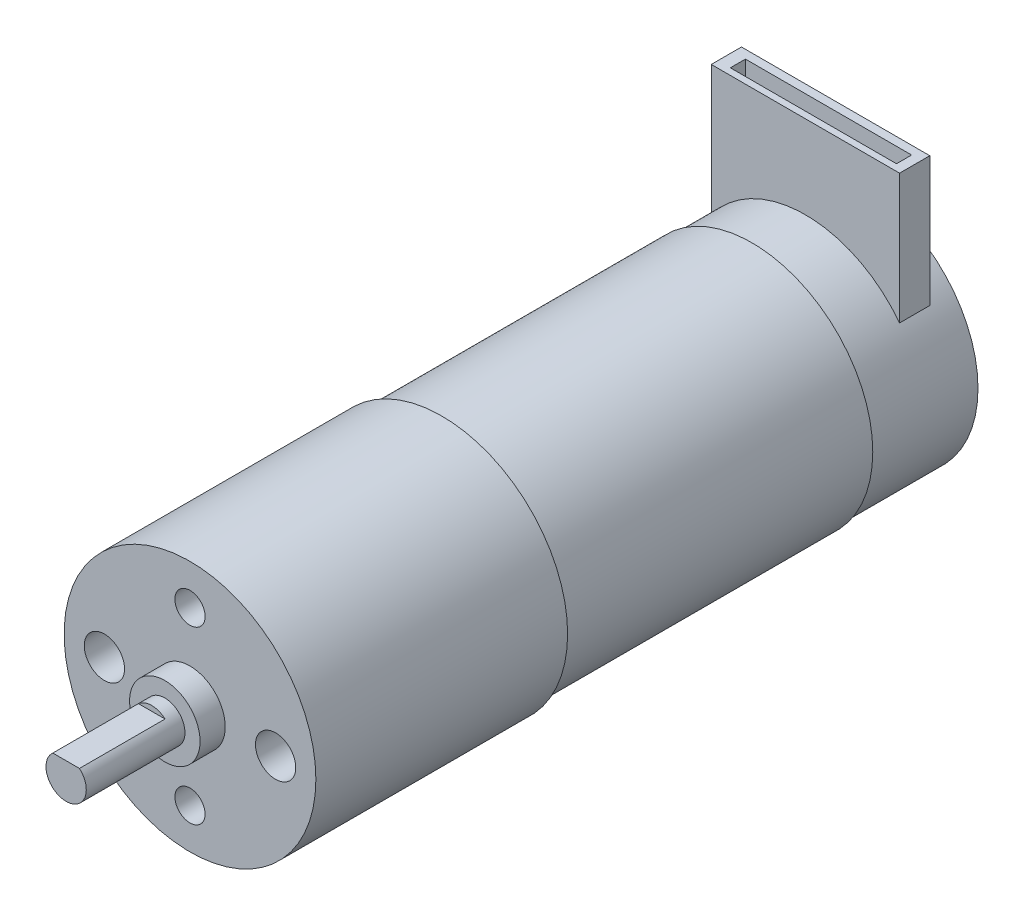
ISO-10303-21;
HEADER;
FILE_DESCRIPTION(('STEP AP214'),'2;1');
FILE_NAME('part.step','',(''),(''),'','','');
FILE_SCHEMA(('AUTOMOTIVE_DESIGN { 1 0 10303 214 1 1 1 1 }'));
ENDSEC;
DATA;
#1=APPLICATION_CONTEXT('core data for automotive mechanical design processes');
#2=APPLICATION_PROTOCOL_DEFINITION('international standard','automotive_design',2000,#1);
#3=PRODUCT_CONTEXT('',#1,'mechanical');
#4=PRODUCT('Part','Part','',(#3));
#5=PRODUCT_RELATED_PRODUCT_CATEGORY('part','',(#4));
#6=PRODUCT_DEFINITION_FORMATION('','',#4);
#7=PRODUCT_DEFINITION_CONTEXT('part definition',#1,'design');
#8=PRODUCT_DEFINITION('design','',#6,#7);
#9=PRODUCT_DEFINITION_SHAPE('','',#8);
#10=(LENGTH_UNIT() NAMED_UNIT(*) SI_UNIT(.MILLI.,.METRE.));
#11=(NAMED_UNIT(*) PLANE_ANGLE_UNIT() SI_UNIT($,.RADIAN.));
#12=(NAMED_UNIT(*) SI_UNIT($,.STERADIAN.) SOLID_ANGLE_UNIT());
#13=UNCERTAINTY_MEASURE_WITH_UNIT(LENGTH_MEASURE(1.E-05),#10,'distance_accuracy_value','');
#14=(GEOMETRIC_REPRESENTATION_CONTEXT(3) GLOBAL_UNCERTAINTY_ASSIGNED_CONTEXT((#13)) GLOBAL_UNIT_ASSIGNED_CONTEXT((#10,
#11,#12)) REPRESENTATION_CONTEXT('',''));
#15=CARTESIAN_POINT('',(0.,0.,0.));
#16=DIRECTION('',(0.,0.,1.));
#17=DIRECTION('',(1.,0.,0.));
#18=AXIS2_PLACEMENT_3D('',#15,#16,#17);
#19=CARTESIAN_POINT('',(0.,0.,-10.7));
#20=DIRECTION('',(0.,0.,1.));
#21=DIRECTION('',(1.,0.,0.));
#22=AXIS2_PLACEMENT_3D('',#19,#20,#21);
#23=CYLINDRICAL_SURFACE('',#22,11.75);
#24=CARTESIAN_POINT('',(0.,0.,0.));
#25=DIRECTION('',(0.,0.,1.));
#26=DIRECTION('',(1.,0.,0.));
#27=AXIS2_PLACEMENT_3D('',#24,#25,#26);
#28=CIRCLE('',#27,11.75);
#29=CARTESIAN_POINT('',(11.75,0.,0.));
#30=VERTEX_POINT('',#29);
#31=EDGE_CURVE('E233',#30,#30,#28,.F.);
#32=ORIENTED_EDGE('',*,*,#31,.T.);
#33=EDGE_LOOP('',(#32));
#34=FACE_BOUND('',#33,.T.);
#35=CARTESIAN_POINT('',(0.,0.,-10.7));
#36=DIRECTION('',(0.,0.,-1.));
#37=DIRECTION('',(-1.,0.,0.));
#38=AXIS2_PLACEMENT_3D('',#35,#36,#37);
#39=CIRCLE('',#38,11.75);
#40=CARTESIAN_POINT('',(-11.75,0.,-10.7));
#41=VERTEX_POINT('',#40);
#42=EDGE_CURVE('E195',#41,#41,#39,.T.);
#43=ORIENTED_EDGE('',*,*,#42,.F.);
#44=EDGE_LOOP('',(#43));
#45=FACE_BOUND('',#44,.T.);
#46=DIRECTION('',(0.,0.,1.));
#47=VECTOR('',#46,1.);
#48=CARTESIAN_POINT('',(-9.34971648878689,7.11655124195045,-10.7));
#49=LINE('',#48,#47);
#50=CARTESIAN_POINT('',(-9.34971648878689,7.11655124195045,-8.31237413965429));
#51=VERTEX_POINT('',#50);
#52=CARTESIAN_POINT('',(-9.34971648878689,7.11655124195045,-5.31237413965429));
#53=VERTEX_POINT('',#52);
#54=EDGE_CURVE('E12',#51,#53,#49,.T.);
#55=ORIENTED_EDGE('',*,*,#54,.F.);
#56=CARTESIAN_POINT('',(0.,0.,-8.31237413965429));
#57=DIRECTION('',(0.,0.,1.));
#58=DIRECTION('',(1.,0.,0.));
#59=AXIS2_PLACEMENT_3D('',#56,#57,#58);
#60=CIRCLE('',#59,11.75);
#61=CARTESIAN_POINT('',(9.34971648878689,7.11655124195045,-8.31237413965429));
#62=VERTEX_POINT('',#61);
#63=EDGE_CURVE('E238',#62,#51,#60,.T.);
#64=ORIENTED_EDGE('',*,*,#63,.F.);
#65=DIRECTION('',(0.,0.,1.));
#66=VECTOR('',#65,1.);
#67=CARTESIAN_POINT('',(9.34971648878689,7.11655124195045,-10.7));
#68=LINE('',#67,#66);
#69=CARTESIAN_POINT('',(9.34971648878689,7.11655124195045,-5.31237413965429));
#70=VERTEX_POINT('',#69);
#71=EDGE_CURVE('E241',#70,#62,#68,.F.);
#72=ORIENTED_EDGE('',*,*,#71,.F.);
#73=CARTESIAN_POINT('',(0.,0.,-5.31237413965429));
#74=DIRECTION('',(0.,0.,-1.));
#75=DIRECTION('',(-1.,0.,0.));
#76=AXIS2_PLACEMENT_3D('',#73,#74,#75);
#77=CIRCLE('',#76,11.75);
#78=EDGE_CURVE('E45',#53,#70,#77,.T.);
#79=ORIENTED_EDGE('',*,*,#78,.F.);
#80=EDGE_LOOP('',(#55,#64,#72,#79));
#81=FACE_BOUND('',#80,.T.);
#82=ADVANCED_FACE('F37',(#34,#45,#81),#23,.T.);
#83=CARTESIAN_POINT('',(0.,0.,68.1));
#84=DIRECTION('',(0.,0.,-1.));
#85=DIRECTION('',(-1.,0.,0.));
#86=AXIS2_PLACEMENT_3D('',#83,#84,#85);
#87=CYLINDRICAL_SURFACE('',#86,2.);
#88=CARTESIAN_POINT('',(0.,0.,58.3));
#89=DIRECTION('',(0.,0.,1.));
#90=DIRECTION('',(1.,0.,0.));
#91=AXIS2_PLACEMENT_3D('',#88,#89,#90);
#92=CIRCLE('',#91,2.);
#93=CARTESIAN_POINT('',(2.,0.,58.3));
#94=VERTEX_POINT('',#93);
#95=EDGE_CURVE('E209',#94,#94,#92,.T.);
#96=ORIENTED_EDGE('',*,*,#95,.T.);
#97=EDGE_LOOP('',(#96));
#98=FACE_BOUND('',#97,.T.);
#99=DIRECTION('',(0.,0.,1.));
#100=VECTOR('',#99,1.);
#101=CARTESIAN_POINT('',(1.3228756555323,1.5,59.6));
#102=LINE('',#101,#100);
#103=CARTESIAN_POINT('',(1.3228756555323,1.5,59.6));
#104=VERTEX_POINT('',#103);
#105=CARTESIAN_POINT('',(1.3228756555323,1.5,68.1));
#106=VERTEX_POINT('',#105);
#107=EDGE_CURVE('E204',#104,#106,#102,.T.);
#108=ORIENTED_EDGE('',*,*,#107,.T.);
#109=CARTESIAN_POINT('',(0.,0.,68.1));
#110=DIRECTION('',(0.,0.,1.));
#111=DIRECTION('',(1.,0.,0.));
#112=AXIS2_PLACEMENT_3D('',#109,#110,#111);
#113=CIRCLE('',#112,2.);
#114=CARTESIAN_POINT('',(-1.3228756555323,1.5,68.1));
#115=VERTEX_POINT('',#114);
#116=EDGE_CURVE('E212',#115,#106,#113,.T.);
#117=ORIENTED_EDGE('',*,*,#116,.F.);
#118=DIRECTION('',(0.,0.,1.));
#119=VECTOR('',#118,1.);
#120=CARTESIAN_POINT('',(-1.3228756555323,1.5,59.6));
#121=LINE('',#120,#119);
#122=CARTESIAN_POINT('',(-1.3228756555323,1.5,59.6));
#123=VERTEX_POINT('',#122);
#124=EDGE_CURVE('E207',#123,#115,#121,.T.);
#125=ORIENTED_EDGE('',*,*,#124,.F.);
#126=CARTESIAN_POINT('',(0.,0.,59.6));
#127=DIRECTION('',(0.,0.,1.));
#128=DIRECTION('',(1.,0.,0.));
#129=AXIS2_PLACEMENT_3D('',#126,#127,#128);
#130=CIRCLE('',#129,2.);
#131=EDGE_CURVE('E201',#104,#123,#130,.T.);
#132=ORIENTED_EDGE('',*,*,#131,.F.);
#133=EDGE_LOOP('',(#108,#117,#125,#132));
#134=FACE_BOUND('',#133,.T.);
#135=ADVANCED_FACE('F272',(#98,#134),#87,.T.);
#136=CARTESIAN_POINT('',(0.,0.,68.1));
#137=DIRECTION('',(0.,0.,1.));
#138=DIRECTION('',(1.,0.,0.));
#139=AXIS2_PLACEMENT_3D('',#136,#137,#138);
#140=PLANE('',#139);
#141=ORIENTED_EDGE('',*,*,#116,.T.);
#142=DIRECTION('',(-1.,0.,0.));
#143=VECTOR('',#142,1.);
#144=CARTESIAN_POINT('',(0.,1.5,68.1));
#145=LINE('',#144,#143);
#146=EDGE_CURVE('E198',#106,#115,#145,.T.);
#147=ORIENTED_EDGE('',*,*,#146,.T.);
#148=EDGE_LOOP('',(#141,#147));
#149=FACE_BOUND('',#148,.T.);
#150=ADVANCED_FACE('F278',(#149),#140,.T.);
#151=CARTESIAN_POINT('',(0.,0.,30.8));
#152=DIRECTION('',(0.,0.,-1.));
#153=DIRECTION('',(-1.,0.,0.));
#154=AXIS2_PLACEMENT_3D('',#151,#152,#153);
#155=CYLINDRICAL_SURFACE('',#154,12.);
#156=CARTESIAN_POINT('',(0.,0.,30.8));
#157=DIRECTION('',(0.,0.,1.));
#158=DIRECTION('',(1.,0.,0.));
#159=AXIS2_PLACEMENT_3D('',#156,#157,#158);
#160=CIRCLE('',#159,12.);
#161=CARTESIAN_POINT('',(12.,0.,30.8));
#162=VERTEX_POINT('',#161);
#163=EDGE_CURVE('E230',#162,#162,#160,.T.);
#164=ORIENTED_EDGE('',*,*,#163,.F.);
#165=EDGE_LOOP('',(#164));
#166=FACE_BOUND('',#165,.T.);
#167=CARTESIAN_POINT('',(0.,0.,0.));
#168=DIRECTION('',(0.,0.,1.));
#169=DIRECTION('',(1.,0.,0.));
#170=AXIS2_PLACEMENT_3D('',#167,#168,#169);
#171=CIRCLE('',#170,12.);
#172=CARTESIAN_POINT('',(12.,0.,0.));
#173=VERTEX_POINT('',#172);
#174=EDGE_CURVE('E227',#173,#173,#171,.T.);
#175=ORIENTED_EDGE('',*,*,#174,.T.);
#176=EDGE_LOOP('',(#175));
#177=FACE_BOUND('',#176,.T.);
#178=ADVANCED_FACE('F39',(#166,#177),#155,.T.);
#179=CARTESIAN_POINT('',(0.,0.,0.));
#180=DIRECTION('',(0.,0.,1.));
#181=DIRECTION('',(1.,0.,0.));
#182=AXIS2_PLACEMENT_3D('',#179,#180,#181);
#183=PLANE('',#182);
#184=ORIENTED_EDGE('',*,*,#31,.F.);
#185=EDGE_LOOP('',(#184));
#186=FACE_BOUND('',#185,.T.);
#187=ORIENTED_EDGE('',*,*,#174,.F.);
#188=EDGE_LOOP('',(#187));
#189=FACE_BOUND('',#188,.T.);
#190=ADVANCED_FACE('F315',(#186,#189),#183,.F.);
#191=CARTESIAN_POINT('',(0.,0.,55.8));
#192=DIRECTION('',(0.,0.,-1.));
#193=DIRECTION('',(-1.,0.,0.));
#194=AXIS2_PLACEMENT_3D('',#191,#192,#193);
#195=CYLINDRICAL_SURFACE('',#194,12.5);
#196=CARTESIAN_POINT('',(0.,0.,55.8));
#197=DIRECTION('',(0.,0.,1.));
#198=DIRECTION('',(1.,0.,0.));
#199=AXIS2_PLACEMENT_3D('',#196,#197,#198);
#200=CIRCLE('',#199,12.5);
#201=CARTESIAN_POINT('',(12.5,0.,55.8));
#202=VERTEX_POINT('',#201);
#203=EDGE_CURVE('E224',#202,#202,#200,.T.);
#204=ORIENTED_EDGE('',*,*,#203,.F.);
#205=EDGE_LOOP('',(#204));
#206=FACE_BOUND('',#205,.T.);
#207=CARTESIAN_POINT('',(0.,0.,30.8));
#208=DIRECTION('',(0.,0.,1.));
#209=DIRECTION('',(1.,0.,0.));
#210=AXIS2_PLACEMENT_3D('',#207,#208,#209);
#211=CIRCLE('',#210,12.5);
#212=CARTESIAN_POINT('',(12.5,0.,30.8));
#213=VERTEX_POINT('',#212);
#214=EDGE_CURVE('E221',#213,#213,#211,.T.);
#215=ORIENTED_EDGE('',*,*,#214,.T.);
#216=EDGE_LOOP('',(#215));
#217=FACE_BOUND('',#216,.T.);
#218=ADVANCED_FACE('F309',(#206,#217),#195,.T.);
#219=CARTESIAN_POINT('',(0.,0.,55.8));
#220=DIRECTION('',(0.,0.,1.));
#221=DIRECTION('',(1.,0.,0.));
#222=AXIS2_PLACEMENT_3D('',#219,#220,#221);
#223=PLANE('',#222);
#224=CARTESIAN_POINT('',(8.5,0.,55.8));
#225=DIRECTION('',(0.,0.,-1.));
#226=DIRECTION('',(-1.,0.,0.));
#227=AXIS2_PLACEMENT_3D('',#224,#225,#226);
#228=CIRCLE('',#227,2.);
#229=CARTESIAN_POINT('',(6.5,0.,55.8));
#230=VERTEX_POINT('',#229);
#231=EDGE_CURVE('E147',#230,#230,#228,.T.);
#232=ORIENTED_EDGE('',*,*,#231,.T.);
#233=EDGE_LOOP('',(#232));
#234=FACE_BOUND('',#233,.T.);
#235=CARTESIAN_POINT('',(-8.5,0.,55.8));
#236=DIRECTION('',(0.,0.,1.));
#237=DIRECTION('',(1.,0.,0.));
#238=AXIS2_PLACEMENT_3D('',#235,#236,#237);
#239=CIRCLE('',#238,2.);
#240=CARTESIAN_POINT('',(-6.5,0.,55.8));
#241=VERTEX_POINT('',#240);
#242=EDGE_CURVE('E154',#241,#241,#239,.T.);
#243=ORIENTED_EDGE('',*,*,#242,.F.);
#244=EDGE_LOOP('',(#243));
#245=FACE_BOUND('',#244,.T.);
#246=CARTESIAN_POINT('',(0.,8.5,55.8));
#247=DIRECTION('',(0.,0.,-1.));
#248=DIRECTION('',(1.,0.,0.));
#249=AXIS2_PLACEMENT_3D('',#246,#247,#248);
#250=CIRCLE('',#249,1.5);
#251=CARTESIAN_POINT('',(1.5,8.5,55.8));
#252=VERTEX_POINT('',#251);
#253=EDGE_CURVE('E160',#252,#252,#250,.T.);
#254=ORIENTED_EDGE('',*,*,#253,.T.);
#255=EDGE_LOOP('',(#254));
#256=FACE_BOUND('',#255,.T.);
#257=CARTESIAN_POINT('',(0.,-8.5,55.8));
#258=DIRECTION('',(0.,0.,1.));
#259=DIRECTION('',(1.,0.,0.));
#260=AXIS2_PLACEMENT_3D('',#257,#258,#259);
#261=CIRCLE('',#260,1.5);
#262=CARTESIAN_POINT('',(1.5,-8.5,55.8));
#263=VERTEX_POINT('',#262);
#264=EDGE_CURVE('E166',#263,#263,#261,.T.);
#265=ORIENTED_EDGE('',*,*,#264,.F.);
#266=EDGE_LOOP('',(#265));
#267=FACE_BOUND('',#266,.T.);
#268=CARTESIAN_POINT('',(0.,0.,55.8));
#269=DIRECTION('',(0.,0.,1.));
#270=DIRECTION('',(1.,0.,0.));
#271=AXIS2_PLACEMENT_3D('',#268,#269,#270);
#272=CIRCLE('',#271,3.5);
#273=CARTESIAN_POINT('',(3.5,0.,55.8));
#274=VERTEX_POINT('',#273);
#275=EDGE_CURVE('E215',#274,#274,#272,.T.);
#276=ORIENTED_EDGE('',*,*,#275,.F.);
#277=EDGE_LOOP('',(#276));
#278=FACE_BOUND('',#277,.T.);
#279=ORIENTED_EDGE('',*,*,#203,.T.);
#280=EDGE_LOOP('',(#279));
#281=FACE_BOUND('',#280,.T.);
#282=ADVANCED_FACE('F306',(#234,#245,#256,#267,#278,#281),#223,.T.);
#283=CARTESIAN_POINT('',(0.,0.,30.8));
#284=DIRECTION('',(0.,0.,1.));
#285=DIRECTION('',(1.,0.,0.));
#286=AXIS2_PLACEMENT_3D('',#283,#284,#285);
#287=PLANE('',#286);
#288=ORIENTED_EDGE('',*,*,#163,.T.);
#289=EDGE_LOOP('',(#288));
#290=FACE_BOUND('',#289,.T.);
#291=ORIENTED_EDGE('',*,*,#214,.F.);
#292=EDGE_LOOP('',(#291));
#293=FACE_BOUND('',#292,.T.);
#294=ADVANCED_FACE('F304',(#290,#293),#287,.F.);
#295=CARTESIAN_POINT('',(0.,0.,58.3));
#296=DIRECTION('',(0.,0.,-1.));
#297=DIRECTION('',(-1.,0.,0.));
#298=AXIS2_PLACEMENT_3D('',#295,#296,#297);
#299=CYLINDRICAL_SURFACE('',#298,3.5);
#300=CARTESIAN_POINT('',(0.,0.,58.3));
#301=DIRECTION('',(0.,0.,1.));
#302=DIRECTION('',(1.,0.,0.));
#303=AXIS2_PLACEMENT_3D('',#300,#301,#302);
#304=CIRCLE('',#303,3.5);
#305=CARTESIAN_POINT('',(3.5,0.,58.3));
#306=VERTEX_POINT('',#305);
#307=EDGE_CURVE('E218',#306,#306,#304,.T.);
#308=ORIENTED_EDGE('',*,*,#307,.F.);
#309=EDGE_LOOP('',(#308));
#310=FACE_BOUND('',#309,.T.);
#311=ORIENTED_EDGE('',*,*,#275,.T.);
#312=EDGE_LOOP('',(#311));
#313=FACE_BOUND('',#312,.T.);
#314=ADVANCED_FACE('F300',(#310,#313),#299,.T.);
#315=CARTESIAN_POINT('',(0.,0.,58.3));
#316=DIRECTION('',(0.,0.,1.));
#317=DIRECTION('',(1.,0.,0.));
#318=AXIS2_PLACEMENT_3D('',#315,#316,#317);
#319=PLANE('',#318);
#320=ORIENTED_EDGE('',*,*,#95,.F.);
#321=EDGE_LOOP('',(#320));
#322=FACE_BOUND('',#321,.T.);
#323=ORIENTED_EDGE('',*,*,#307,.T.);
#324=EDGE_LOOP('',(#323));
#325=FACE_BOUND('',#324,.T.);
#326=ADVANCED_FACE('F293',(#322,#325),#319,.T.);
#327=CARTESIAN_POINT('',(0.,1.5,59.6));
#328=DIRECTION('',(0.,1.,0.));
#329=DIRECTION('',(0.,0.,1.));
#330=AXIS2_PLACEMENT_3D('',#327,#328,#329);
#331=PLANE('',#330);
#332=ORIENTED_EDGE('',*,*,#146,.F.);
#333=ORIENTED_EDGE('',*,*,#107,.F.);
#334=DIRECTION('',(-1.,0.,0.));
#335=VECTOR('',#334,1.);
#336=CARTESIAN_POINT('',(0.,1.5,59.6));
#337=LINE('',#336,#335);
#338=EDGE_CURVE('E199',#104,#123,#337,.T.);
#339=ORIENTED_EDGE('',*,*,#338,.T.);
#340=ORIENTED_EDGE('',*,*,#124,.T.);
#341=EDGE_LOOP('',(#332,#333,#339,#340));
#342=FACE_BOUND('',#341,.T.);
#343=ADVANCED_FACE('F289',(#342),#331,.T.);
#344=CARTESIAN_POINT('',(0.,0.,59.6));
#345=DIRECTION('',(0.,0.,1.));
#346=DIRECTION('',(1.,0.,0.));
#347=AXIS2_PLACEMENT_3D('',#344,#345,#346);
#348=PLANE('',#347);
#349=ORIENTED_EDGE('',*,*,#338,.F.);
#350=ORIENTED_EDGE('',*,*,#131,.T.);
#351=EDGE_LOOP('',(#349,#350));
#352=FACE_BOUND('',#351,.T.);
#353=ADVANCED_FACE('F286',(#352),#348,.T.);
#354=CARTESIAN_POINT('',(0.,0.,-10.7));
#355=DIRECTION('',(0.,0.,-1.));
#356=DIRECTION('',(-1.,0.,0.));
#357=AXIS2_PLACEMENT_3D('',#354,#355,#356);
#358=PLANE('',#357);
#359=ORIENTED_EDGE('',*,*,#42,.T.);
#360=EDGE_LOOP('',(#359));
#361=FACE_BOUND('',#360,.T.);
#362=ADVANCED_FACE('F284',(#361),#358,.T.);
#363=CARTESIAN_POINT('',(-9.34971648878689,20.,-8.31237413965429));
#364=DIRECTION('',(1.,0.,0.));
#365=DIRECTION('',(0.,0.,-1.));
#366=AXIS2_PLACEMENT_3D('',#363,#364,#365);
#367=PLANE('',#366);
#368=DIRECTION('',(0.,-1.,0.));
#369=VECTOR('',#368,1.);
#370=CARTESIAN_POINT('',(-9.34971648878689,20.,-8.31237413965429));
#371=LINE('',#370,#369);
#372=CARTESIAN_POINT('',(-9.34971648878689,20.,-8.31237413965429));
#373=VERTEX_POINT('',#372);
#374=EDGE_CURVE('E183',#373,#51,#371,.T.);
#375=ORIENTED_EDGE('',*,*,#374,.T.);
#376=ORIENTED_EDGE('',*,*,#54,.T.);
#377=DIRECTION('',(0.,-1.,0.));
#378=VECTOR('',#377,1.);
#379=CARTESIAN_POINT('',(-9.34971648878689,20.,-5.31237413965429));
#380=LINE('',#379,#378);
#381=CARTESIAN_POINT('',(-9.34971648878689,20.,-5.31237413965429));
#382=VERTEX_POINT('',#381);
#383=EDGE_CURVE('E192',#382,#53,#380,.T.);
#384=ORIENTED_EDGE('',*,*,#383,.F.);
#385=DIRECTION('',(0.,0.,1.));
#386=VECTOR('',#385,1.);
#387=CARTESIAN_POINT('',(-9.34971648878689,20.,-8.31237413965429));
#388=LINE('',#387,#386);
#389=EDGE_CURVE('E172',#373,#382,#388,.T.);
#390=ORIENTED_EDGE('',*,*,#389,.F.);
#391=EDGE_LOOP('',(#375,#376,#384,#390));
#392=FACE_BOUND('',#391,.T.);
#393=ADVANCED_FACE('F257',(#392),#367,.F.);
#394=CARTESIAN_POINT('',(9.34971648878689,20.,-8.31237413965429));
#395=DIRECTION('',(-1.,0.,0.));
#396=DIRECTION('',(0.,0.,1.));
#397=AXIS2_PLACEMENT_3D('',#394,#395,#396);
#398=PLANE('',#397);
#399=DIRECTION('',(0.,-1.,0.));
#400=VECTOR('',#399,1.);
#401=CARTESIAN_POINT('',(9.34971648878689,20.,-5.31237413965429));
#402=LINE('',#401,#400);
#403=CARTESIAN_POINT('',(9.34971648878689,20.,-5.31237413965429));
#404=VERTEX_POINT('',#403);
#405=EDGE_CURVE('E189',#404,#70,#402,.T.);
#406=ORIENTED_EDGE('',*,*,#405,.T.);
#407=ORIENTED_EDGE('',*,*,#71,.T.);
#408=DIRECTION('',(0.,-1.,0.));
#409=VECTOR('',#408,1.);
#410=CARTESIAN_POINT('',(9.34971648878689,20.,-8.31237413965429));
#411=LINE('',#410,#409);
#412=CARTESIAN_POINT('',(9.34971648878689,20.,-8.31237413965429));
#413=VERTEX_POINT('',#412);
#414=EDGE_CURVE('E186',#413,#62,#411,.T.);
#415=ORIENTED_EDGE('',*,*,#414,.F.);
#416=DIRECTION('',(0.,0.,-1.));
#417=VECTOR('',#416,1.);
#418=CARTESIAN_POINT('',(9.34971648878689,20.,-8.31237413965429));
#419=LINE('',#418,#417);
#420=EDGE_CURVE('E179',#404,#413,#419,.T.);
#421=ORIENTED_EDGE('',*,*,#420,.F.);
#422=EDGE_LOOP('',(#406,#407,#415,#421));
#423=FACE_BOUND('',#422,.T.);
#424=ADVANCED_FACE('F249',(#423),#398,.F.);
#425=CARTESIAN_POINT('',(9.34971648878689,20.,-5.31237413965429));
#426=DIRECTION('',(0.,0.,-1.));
#427=DIRECTION('',(-1.,0.,0.));
#428=AXIS2_PLACEMENT_3D('',#425,#426,#427);
#429=PLANE('',#428);
#430=ORIENTED_EDGE('',*,*,#383,.T.);
#431=ORIENTED_EDGE('',*,*,#78,.T.);
#432=ORIENTED_EDGE('',*,*,#405,.F.);
#433=DIRECTION('',(1.,0.,0.));
#434=VECTOR('',#433,1.);
#435=CARTESIAN_POINT('',(9.34971648878689,20.,-5.31237413965429));
#436=LINE('',#435,#434);
#437=EDGE_CURVE('E177',#382,#404,#436,.T.);
#438=ORIENTED_EDGE('',*,*,#437,.F.);
#439=EDGE_LOOP('',(#430,#431,#432,#438));
#440=FACE_BOUND('',#439,.T.);
#441=ADVANCED_FACE('F245',(#440),#429,.F.);
#442=CARTESIAN_POINT('',(9.34971648878689,20.,-8.31237413965429));
#443=DIRECTION('',(0.,0.,1.));
#444=DIRECTION('',(1.,0.,0.));
#445=AXIS2_PLACEMENT_3D('',#442,#443,#444);
#446=PLANE('',#445);
#447=ORIENTED_EDGE('',*,*,#414,.T.);
#448=ORIENTED_EDGE('',*,*,#63,.T.);
#449=ORIENTED_EDGE('',*,*,#374,.F.);
#450=DIRECTION('',(-1.,0.,0.));
#451=VECTOR('',#450,1.);
#452=CARTESIAN_POINT('',(9.34971648878689,20.,-8.31237413965429));
#453=LINE('',#452,#451);
#454=EDGE_CURVE('E181',#413,#373,#453,.T.);
#455=ORIENTED_EDGE('',*,*,#454,.F.);
#456=EDGE_LOOP('',(#447,#448,#449,#455));
#457=FACE_BOUND('',#456,.T.);
#458=ADVANCED_FACE('F259',(#457),#446,.F.);
#459=CARTESIAN_POINT('',(0.,20.,0.));
#460=DIRECTION('',(0.,-1.,0.));
#461=DIRECTION('',(0.,0.,-1.));
#462=AXIS2_PLACEMENT_3D('',#459,#460,#461);
#463=PLANE('',#462);
#464=DIRECTION('',(1.,0.,0.));
#465=VECTOR('',#464,1.);
#466=CARTESIAN_POINT('',(8.38729640794611,20.,-5.96838946504422));
#467=LINE('',#466,#465);
#468=CARTESIAN_POINT('',(-8.11270359205389,20.,-5.96838946504422));
#469=VERTEX_POINT('',#468);
#470=CARTESIAN_POINT('',(8.38729640794611,20.,-5.96838946504422));
#471=VERTEX_POINT('',#470);
#472=EDGE_CURVE('E141',#469,#471,#467,.T.);
#473=ORIENTED_EDGE('',*,*,#472,.F.);
#474=DIRECTION('',(0.,0.,1.));
#475=VECTOR('',#474,1.);
#476=CARTESIAN_POINT('',(-8.11270359205389,20.,-7.46838946504422));
#477=LINE('',#476,#475);
#478=CARTESIAN_POINT('',(-8.11270359205389,20.,-7.46838946504422));
#479=VERTEX_POINT('',#478);
#480=EDGE_CURVE('E52',#479,#469,#477,.T.);
#481=ORIENTED_EDGE('',*,*,#480,.F.);
#482=DIRECTION('',(-1.,0.,0.));
#483=VECTOR('',#482,1.);
#484=CARTESIAN_POINT('',(8.38729640794611,20.,-7.46838946504422));
#485=LINE('',#484,#483);
#486=CARTESIAN_POINT('',(8.38729640794611,20.,-7.46838946504422));
#487=VERTEX_POINT('',#486);
#488=EDGE_CURVE('E132',#487,#479,#485,.T.);
#489=ORIENTED_EDGE('',*,*,#488,.F.);
#490=DIRECTION('',(0.,0.,-1.));
#491=VECTOR('',#490,1.);
#492=CARTESIAN_POINT('',(8.38729640794611,20.,-7.46838946504422));
#493=LINE('',#492,#491);
#494=EDGE_CURVE('E135',#471,#487,#493,.T.);
#495=ORIENTED_EDGE('',*,*,#494,.F.);
#496=EDGE_LOOP('',(#473,#481,#489,#495));
#497=FACE_BOUND('',#496,.T.);
#498=ORIENTED_EDGE('',*,*,#389,.T.);
#499=ORIENTED_EDGE('',*,*,#437,.T.);
#500=ORIENTED_EDGE('',*,*,#420,.T.);
#501=ORIENTED_EDGE('',*,*,#454,.T.);
#502=EDGE_LOOP('',(#498,#499,#500,#501));
#503=FACE_BOUND('',#502,.T.);
#504=ADVANCED_FACE('F253',(#497,#503),#463,.F.);
#505=CARTESIAN_POINT('',(0.,-8.5,45.8));
#506=DIRECTION('',(0.,0.,1.));
#507=DIRECTION('',(1.,0.,0.));
#508=AXIS2_PLACEMENT_3D('',#505,#506,#507);
#509=CYLINDRICAL_SURFACE('',#508,1.5);
#510=CARTESIAN_POINT('',(0.,-8.5,45.8));
#511=DIRECTION('',(0.,0.,1.));
#512=DIRECTION('',(1.,0.,0.));
#513=AXIS2_PLACEMENT_3D('',#510,#511,#512);
#514=CIRCLE('',#513,1.5);
#515=CARTESIAN_POINT('',(1.5,-8.5,45.8));
#516=VERTEX_POINT('',#515);
#517=EDGE_CURVE('E169',#516,#516,#514,.T.);
#518=ORIENTED_EDGE('',*,*,#517,.F.);
#519=EDGE_LOOP('',(#518));
#520=FACE_BOUND('',#519,.T.);
#521=ORIENTED_EDGE('',*,*,#264,.T.);
#522=EDGE_LOOP('',(#521));
#523=FACE_BOUND('',#522,.T.);
#524=ADVANCED_FACE('F266',(#520,#523),#509,.F.);
#525=CARTESIAN_POINT('',(0.,-8.5,45.8));
#526=DIRECTION('',(0.,0.,1.));
#527=DIRECTION('',(1.,0.,0.));
#528=AXIS2_PLACEMENT_3D('',#525,#526,#527);
#529=PLANE('',#528);
#530=ORIENTED_EDGE('',*,*,#517,.T.);
#531=EDGE_LOOP('',(#530));
#532=FACE_BOUND('',#531,.T.);
#533=ADVANCED_FACE('F471',(#532),#529,.T.);
#534=CARTESIAN_POINT('',(0.,8.5,45.8));
#535=DIRECTION('',(0.,0.,1.));
#536=DIRECTION('',(1.,0.,0.));
#537=AXIS2_PLACEMENT_3D('',#534,#535,#536);
#538=CYLINDRICAL_SURFACE('',#537,1.5);
#539=CARTESIAN_POINT('',(0.,8.5,45.8));
#540=DIRECTION('',(0.,0.,-1.));
#541=DIRECTION('',(1.,0.,0.));
#542=AXIS2_PLACEMENT_3D('',#539,#540,#541);
#543=CIRCLE('',#542,1.5);
#544=CARTESIAN_POINT('',(1.5,8.5,45.8));
#545=VERTEX_POINT('',#544);
#546=EDGE_CURVE('E163',#545,#545,#543,.T.);
#547=ORIENTED_EDGE('',*,*,#546,.T.);
#548=EDGE_LOOP('',(#547));
#549=FACE_BOUND('',#548,.T.);
#550=ORIENTED_EDGE('',*,*,#253,.F.);
#551=EDGE_LOOP('',(#550));
#552=FACE_BOUND('',#551,.T.);
#553=ADVANCED_FACE('F467',(#549,#552),#538,.F.);
#554=CARTESIAN_POINT('',(0.,8.5,45.8));
#555=DIRECTION('',(0.,0.,1.));
#556=DIRECTION('',(1.,0.,0.));
#557=AXIS2_PLACEMENT_3D('',#554,#555,#556);
#558=PLANE('',#557);
#559=ORIENTED_EDGE('',*,*,#546,.F.);
#560=EDGE_LOOP('',(#559));
#561=FACE_BOUND('',#560,.T.);
#562=ADVANCED_FACE('F463',(#561),#558,.T.);
#563=CARTESIAN_POINT('',(-8.5,0.,45.8));
#564=DIRECTION('',(0.,0.,1.));
#565=DIRECTION('',(1.,0.,0.));
#566=AXIS2_PLACEMENT_3D('',#563,#564,#565);
#567=CYLINDRICAL_SURFACE('',#566,2.);
#568=CARTESIAN_POINT('',(-8.5,0.,45.8));
#569=DIRECTION('',(0.,0.,1.));
#570=DIRECTION('',(1.,0.,0.));
#571=AXIS2_PLACEMENT_3D('',#568,#569,#570);
#572=CIRCLE('',#571,2.);
#573=CARTESIAN_POINT('',(-6.5,0.,45.8));
#574=VERTEX_POINT('',#573);
#575=EDGE_CURVE('E157',#574,#574,#572,.T.);
#576=ORIENTED_EDGE('',*,*,#575,.F.);
#577=EDGE_LOOP('',(#576));
#578=FACE_BOUND('',#577,.T.);
#579=ORIENTED_EDGE('',*,*,#242,.T.);
#580=EDGE_LOOP('',(#579));
#581=FACE_BOUND('',#580,.T.);
#582=ADVANCED_FACE('F459',(#578,#581),#567,.F.);
#583=CARTESIAN_POINT('',(-8.5,0.,45.8));
#584=DIRECTION('',(0.,0.,1.));
#585=DIRECTION('',(1.,0.,0.));
#586=AXIS2_PLACEMENT_3D('',#583,#584,#585);
#587=PLANE('',#586);
#588=ORIENTED_EDGE('',*,*,#575,.T.);
#589=EDGE_LOOP('',(#588));
#590=FACE_BOUND('',#589,.T.);
#591=ADVANCED_FACE('F380',(#590),#587,.T.);
#592=CARTESIAN_POINT('',(8.5,0.,45.8));
#593=DIRECTION('',(0.,0.,1.));
#594=DIRECTION('',(1.,0.,0.));
#595=AXIS2_PLACEMENT_3D('',#592,#593,#594);
#596=CYLINDRICAL_SURFACE('',#595,2.);
#597=CARTESIAN_POINT('',(8.5,0.,45.8));
#598=DIRECTION('',(0.,0.,-1.));
#599=DIRECTION('',(-1.,0.,0.));
#600=AXIS2_PLACEMENT_3D('',#597,#598,#599);
#601=CIRCLE('',#600,2.);
#602=CARTESIAN_POINT('',(6.5,0.,45.8));
#603=VERTEX_POINT('',#602);
#604=EDGE_CURVE('E151',#603,#603,#601,.T.);
#605=ORIENTED_EDGE('',*,*,#604,.T.);
#606=EDGE_LOOP('',(#605));
#607=FACE_BOUND('',#606,.T.);
#608=ORIENTED_EDGE('',*,*,#231,.F.);
#609=EDGE_LOOP('',(#608));
#610=FACE_BOUND('',#609,.T.);
#611=ADVANCED_FACE('F385',(#607,#610),#596,.F.);
#612=CARTESIAN_POINT('',(8.5,0.,45.8));
#613=DIRECTION('',(0.,0.,1.));
#614=DIRECTION('',(-1.,0.,0.));
#615=AXIS2_PLACEMENT_3D('',#612,#613,#614);
#616=PLANE('',#615);
#617=ORIENTED_EDGE('',*,*,#604,.F.);
#618=EDGE_LOOP('',(#617));
#619=FACE_BOUND('',#618,.T.);
#620=ADVANCED_FACE('F390',(#619),#616,.T.);
#621=CARTESIAN_POINT('',(-8.11270359205389,10.,-7.46838946504422));
#622=DIRECTION('',(-1.,0.,0.));
#623=DIRECTION('',(0.,0.,1.));
#624=AXIS2_PLACEMENT_3D('',#621,#622,#623);
#625=PLANE('',#624);
#626=ORIENTED_EDGE('',*,*,#480,.T.);
#627=DIRECTION('',(0.,1.,0.));
#628=VECTOR('',#627,1.);
#629=CARTESIAN_POINT('',(-8.11270359205389,10.,-5.96838946504422));
#630=LINE('',#629,#628);
#631=CARTESIAN_POINT('',(-8.11270359205389,10.,-5.96838946504422));
#632=VERTEX_POINT('',#631);
#633=EDGE_CURVE('E110',#632,#469,#630,.T.);
#634=ORIENTED_EDGE('',*,*,#633,.F.);
#635=DIRECTION('',(0.,0.,1.));
#636=VECTOR('',#635,1.);
#637=CARTESIAN_POINT('',(-8.11270359205389,10.,-7.46838946504422));
#638=LINE('',#637,#636);
#639=CARTESIAN_POINT('',(-8.11270359205389,10.,-7.46838946504422));
#640=VERTEX_POINT('',#639);
#641=EDGE_CURVE('E114',#640,#632,#638,.T.);
#642=ORIENTED_EDGE('',*,*,#641,.F.);
#643=DIRECTION('',(0.,1.,0.));
#644=VECTOR('',#643,1.);
#645=CARTESIAN_POINT('',(-8.11270359205389,10.,-7.46838946504422));
#646=LINE('',#645,#644);
#647=EDGE_CURVE('E145',#640,#479,#646,.T.);
#648=ORIENTED_EDGE('',*,*,#647,.T.);
#649=EDGE_LOOP('',(#626,#634,#642,#648));
#650=FACE_BOUND('',#649,.T.);
#651=ADVANCED_FACE('F112',(#650),#625,.F.);
#652=CARTESIAN_POINT('',(8.38729640794611,10.,-7.46838946504422));
#653=DIRECTION('',(0.,0.,-1.));
#654=DIRECTION('',(-1.,0.,0.));
#655=AXIS2_PLACEMENT_3D('',#652,#653,#654);
#656=PLANE('',#655);
#657=ORIENTED_EDGE('',*,*,#488,.T.);
#658=ORIENTED_EDGE('',*,*,#647,.F.);
#659=DIRECTION('',(-1.,0.,0.));
#660=VECTOR('',#659,1.);
#661=CARTESIAN_POINT('',(8.38729640794611,10.,-7.46838946504422));
#662=LINE('',#661,#660);
#663=CARTESIAN_POINT('',(8.38729640794611,10.,-7.46838946504422));
#664=VERTEX_POINT('',#663);
#665=EDGE_CURVE('E120',#664,#640,#662,.T.);
#666=ORIENTED_EDGE('',*,*,#665,.F.);
#667=DIRECTION('',(0.,1.,0.));
#668=VECTOR('',#667,1.);
#669=CARTESIAN_POINT('',(8.38729640794611,10.,-7.46838946504422));
#670=LINE('',#669,#668);
#671=EDGE_CURVE('E148',#664,#487,#670,.T.);
#672=ORIENTED_EDGE('',*,*,#671,.T.);
#673=EDGE_LOOP('',(#657,#658,#666,#672));
#674=FACE_BOUND('',#673,.T.);
#675=ADVANCED_FACE('F418',(#674),#656,.F.);
#676=CARTESIAN_POINT('',(8.38729640794611,10.,-7.46838946504422));
#677=DIRECTION('',(1.,0.,0.));
#678=DIRECTION('',(0.,0.,-1.));
#679=AXIS2_PLACEMENT_3D('',#676,#677,#678);
#680=PLANE('',#679);
#681=ORIENTED_EDGE('',*,*,#494,.T.);
#682=ORIENTED_EDGE('',*,*,#671,.F.);
#683=DIRECTION('',(0.,0.,-1.));
#684=VECTOR('',#683,1.);
#685=CARTESIAN_POINT('',(8.38729640794611,10.,-7.46838946504422));
#686=LINE('',#685,#684);
#687=CARTESIAN_POINT('',(8.38729640794611,10.,-5.96838946504422));
#688=VERTEX_POINT('',#687);
#689=EDGE_CURVE('E128',#688,#664,#686,.T.);
#690=ORIENTED_EDGE('',*,*,#689,.F.);
#691=DIRECTION('',(0.,1.,0.));
#692=VECTOR('',#691,1.);
#693=CARTESIAN_POINT('',(8.38729640794611,10.,-5.96838946504422));
#694=LINE('',#693,#692);
#695=EDGE_CURVE('E119',#688,#471,#694,.T.);
#696=ORIENTED_EDGE('',*,*,#695,.T.);
#697=EDGE_LOOP('',(#681,#682,#690,#696));
#698=FACE_BOUND('',#697,.T.);
#699=ADVANCED_FACE('F427',(#698),#680,.F.);
#700=CARTESIAN_POINT('',(8.38729640794611,10.,-5.96838946504422));
#701=DIRECTION('',(0.,0.,1.));
#702=DIRECTION('',(1.,0.,0.));
#703=AXIS2_PLACEMENT_3D('',#700,#701,#702);
#704=PLANE('',#703);
#705=ORIENTED_EDGE('',*,*,#472,.T.);
#706=ORIENTED_EDGE('',*,*,#695,.F.);
#707=DIRECTION('',(1.,0.,0.));
#708=VECTOR('',#707,1.);
#709=CARTESIAN_POINT('',(8.38729640794611,10.,-5.96838946504422));
#710=LINE('',#709,#708);
#711=EDGE_CURVE('E123',#632,#688,#710,.T.);
#712=ORIENTED_EDGE('',*,*,#711,.F.);
#713=ORIENTED_EDGE('',*,*,#633,.T.);
#714=EDGE_LOOP('',(#705,#706,#712,#713));
#715=FACE_BOUND('',#714,.T.);
#716=ADVANCED_FACE('F124',(#715),#704,.F.);
#717=CARTESIAN_POINT('',(0.,10.,0.));
#718=DIRECTION('',(0.,-1.,0.));
#719=DIRECTION('',(0.,0.,-1.));
#720=AXIS2_PLACEMENT_3D('',#717,#718,#719);
#721=PLANE('',#720);
#722=ORIENTED_EDGE('',*,*,#641,.T.);
#723=ORIENTED_EDGE('',*,*,#711,.T.);
#724=ORIENTED_EDGE('',*,*,#689,.T.);
#725=ORIENTED_EDGE('',*,*,#665,.T.);
#726=EDGE_LOOP('',(#722,#723,#724,#725));
#727=FACE_BOUND('',#726,.T.);
#728=ADVANCED_FACE('F130',(#727),#721,.F.);
#729=CLOSED_SHELL('',(#82,#135,#150,#178,#190,#218,#282,#294,#314,#326,#343,#353,#362,#393,#424,
#441,#458,#504,#524,#533,#553,#562,#582,#591,#611,#620,#651,#675,#699,#716,#728));
#730=MANIFOLD_SOLID_BREP('B2',#729);
#731=ADVANCED_BREP_SHAPE_REPRESENTATION('',(#18,#730),#14);
#732=SHAPE_DEFINITION_REPRESENTATION(#9,#731);
ENDSEC;
END-ISO-10303-21;
